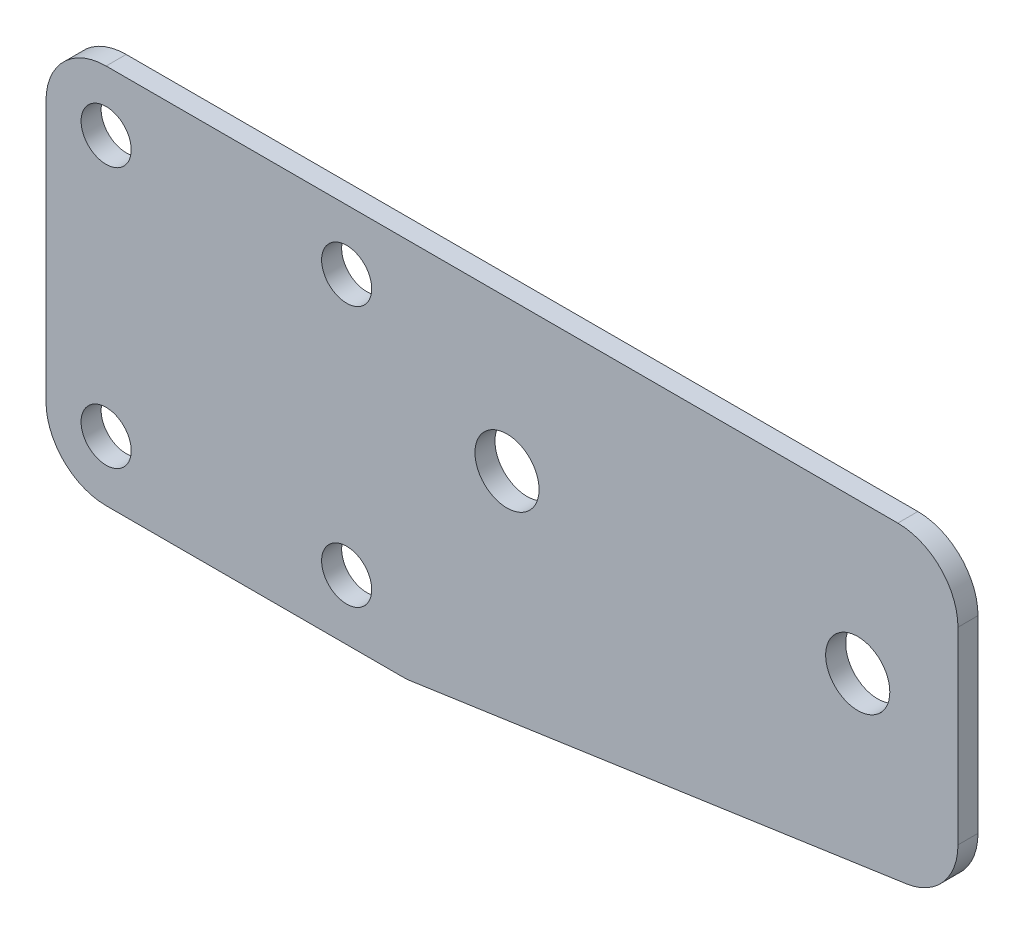
ISO-10303-21;
HEADER;
FILE_DESCRIPTION(('STEP AP214'),'2;1');
FILE_NAME('part.step','',(''),(''),'','','');
FILE_SCHEMA(('AUTOMOTIVE_DESIGN { 1 0 10303 214 1 1 1 1 }'));
ENDSEC;
DATA;
#1=APPLICATION_CONTEXT('core data for automotive mechanical design processes');
#2=APPLICATION_PROTOCOL_DEFINITION('international standard','automotive_design',2000,#1);
#3=PRODUCT_CONTEXT('',#1,'mechanical');
#4=PRODUCT('Part','Part','',(#3));
#5=PRODUCT_RELATED_PRODUCT_CATEGORY('part','',(#4));
#6=PRODUCT_DEFINITION_FORMATION('','',#4);
#7=PRODUCT_DEFINITION_CONTEXT('part definition',#1,'design');
#8=PRODUCT_DEFINITION('design','',#6,#7);
#9=PRODUCT_DEFINITION_SHAPE('','',#8);
#10=(LENGTH_UNIT() NAMED_UNIT(*) SI_UNIT(.MILLI.,.METRE.));
#11=(NAMED_UNIT(*) PLANE_ANGLE_UNIT() SI_UNIT($,.RADIAN.));
#12=(NAMED_UNIT(*) SI_UNIT($,.STERADIAN.) SOLID_ANGLE_UNIT());
#13=UNCERTAINTY_MEASURE_WITH_UNIT(LENGTH_MEASURE(1.E-05),#10,'distance_accuracy_value','');
#14=(GEOMETRIC_REPRESENTATION_CONTEXT(3) GLOBAL_UNCERTAINTY_ASSIGNED_CONTEXT((#13)) GLOBAL_UNIT_ASSIGNED_CONTEXT((#10,
#11,#12)) REPRESENTATION_CONTEXT('',''));
#15=CARTESIAN_POINT('',(0.,0.,0.));
#16=DIRECTION('',(0.,0.,1.));
#17=DIRECTION('',(1.,0.,0.));
#18=AXIS2_PLACEMENT_3D('',#15,#16,#17);
#19=CARTESIAN_POINT('',(0.,0.,1.));
#20=DIRECTION('',(0.,0.,1.));
#21=DIRECTION('',(1.,0.,0.));
#22=AXIS2_PLACEMENT_3D('',#19,#20,#21);
#23=PLANE('',#22);
#24=CARTESIAN_POINT('',(31.5,2.00000000000001,1.));
#25=DIRECTION('',(0.,0.,1.));
#26=DIRECTION('',(1.,0.,0.));
#27=AXIS2_PLACEMENT_3D('',#24,#25,#26);
#28=CIRCLE('',#27,1.6);
#29=CARTESIAN_POINT('',(33.1,2.00000000000001,1.));
#30=VERTEX_POINT('',#29);
#31=EDGE_CURVE('E224',#30,#30,#28,.T.);
#32=ORIENTED_EDGE('',*,*,#31,.F.);
#33=EDGE_LOOP('',(#32));
#34=FACE_BOUND('',#33,.T.);
#35=CARTESIAN_POINT('',(-5.99999999999996,-6.50000000000005,1.));
#36=DIRECTION('',(0.,0.,1.));
#37=DIRECTION('',(-1.,0.,0.));
#38=AXIS2_PLACEMENT_3D('',#35,#36,#37);
#39=CIRCLE('',#38,1.25);
#40=CARTESIAN_POINT('',(-7.24999999999996,-6.50000000000005,1.));
#41=VERTEX_POINT('',#40);
#42=EDGE_CURVE('E212',#41,#41,#39,.T.);
#43=ORIENTED_EDGE('',*,*,#42,.F.);
#44=EDGE_LOOP('',(#43));
#45=FACE_BOUND('',#44,.T.);
#46=CARTESIAN_POINT('',(6.00000000000004,-6.50000000000005,1.));
#47=DIRECTION('',(0.,0.,1.));
#48=DIRECTION('',(1.,0.,0.));
#49=AXIS2_PLACEMENT_3D('',#46,#47,#48);
#50=CIRCLE('',#49,1.25);
#51=CARTESIAN_POINT('',(7.25000000000004,-6.50000000000005,1.));
#52=VERTEX_POINT('',#51);
#53=EDGE_CURVE('E138',#52,#52,#50,.T.);
#54=ORIENTED_EDGE('',*,*,#53,.F.);
#55=EDGE_LOOP('',(#54));
#56=FACE_BOUND('',#55,.T.);
#57=DIRECTION('',(1.,0.,0.));
#58=VECTOR('',#57,1.);
#59=CARTESIAN_POINT('',(-9.,-9.49999999999999,1.));
#60=LINE('',#59,#58);
#61=CARTESIAN_POINT('',(-6.,-9.49999999999999,1.));
#62=VERTEX_POINT('',#61);
#63=CARTESIAN_POINT('',(8.78296015261463,-9.49999999999999,1.));
#64=VERTEX_POINT('',#63);
#65=EDGE_CURVE('E147',#62,#64,#60,.T.);
#66=ORIENTED_EDGE('',*,*,#65,.T.);
#67=CARTESIAN_POINT('',(8.78296015261463,-6.49999999999999,1.));
#68=DIRECTION('',(0.,0.,1.));
#69=DIRECTION('',(1.,0.,0.));
#70=AXIS2_PLACEMENT_3D('',#67,#68,#69);
#71=CIRCLE('',#70,3.);
#72=CARTESIAN_POINT('',(9.21477968975695,-9.46875931785353,1.));
#73=VERTEX_POINT('',#72);
#74=EDGE_CURVE('E173',#64,#73,#71,.T.);
#75=ORIENTED_EDGE('',*,*,#74,.T.);
#76=DIRECTION('',(0.989586439284512,0.143939845714111,0.));
#77=VECTOR('',#76,1.);
#78=CARTESIAN_POINT('',(36.5,-5.49999999999999,1.));
#79=LINE('',#78,#77);
#80=CARTESIAN_POINT('',(33.9318195371423,-5.8735535218702,1.));
#81=VERTEX_POINT('',#80);
#82=EDGE_CURVE('E130',#73,#81,#79,.T.);
#83=ORIENTED_EDGE('',*,*,#82,.T.);
#84=CARTESIAN_POINT('',(33.5,-2.90479420401667,1.));
#85=DIRECTION('',(0.,0.,1.));
#86=DIRECTION('',(1.,0.,0.));
#87=AXIS2_PLACEMENT_3D('',#84,#85,#86);
#88=CIRCLE('',#87,3.);
#89=CARTESIAN_POINT('',(36.5,-2.90479420401667,1.));
#90=VERTEX_POINT('',#89);
#91=EDGE_CURVE('E171',#81,#90,#88,.T.);
#92=ORIENTED_EDGE('',*,*,#91,.T.);
#93=DIRECTION('',(0.,1.,0.));
#94=VECTOR('',#93,1.);
#95=CARTESIAN_POINT('',(36.5,9.50000000000001,1.));
#96=LINE('',#95,#94);
#97=CARTESIAN_POINT('',(36.5,6.5,1.));
#98=VERTEX_POINT('',#97);
#99=EDGE_CURVE('E200',#90,#98,#96,.T.);
#100=ORIENTED_EDGE('',*,*,#99,.T.);
#101=CARTESIAN_POINT('',(33.5,6.5,1.));
#102=DIRECTION('',(0.,0.,1.));
#103=DIRECTION('',(1.,0.,0.));
#104=AXIS2_PLACEMENT_3D('',#101,#102,#103);
#105=CIRCLE('',#104,3.);
#106=CARTESIAN_POINT('',(33.5,9.50000000000001,1.));
#107=VERTEX_POINT('',#106);
#108=EDGE_CURVE('E169',#98,#107,#105,.T.);
#109=ORIENTED_EDGE('',*,*,#108,.T.);
#110=DIRECTION('',(-1.,0.,0.));
#111=VECTOR('',#110,1.);
#112=CARTESIAN_POINT('',(9.,9.5,1.));
#113=LINE('',#112,#111);
#114=CARTESIAN_POINT('',(-6.,9.5,1.));
#115=VERTEX_POINT('',#114);
#116=EDGE_CURVE('E199',#107,#115,#113,.T.);
#117=ORIENTED_EDGE('',*,*,#116,.T.);
#118=CARTESIAN_POINT('',(-6.,6.5,1.));
#119=DIRECTION('',(0.,0.,1.));
#120=DIRECTION('',(1.,0.,0.));
#121=AXIS2_PLACEMENT_3D('',#118,#119,#120);
#122=CIRCLE('',#121,3.);
#123=CARTESIAN_POINT('',(-9.,6.5,1.));
#124=VERTEX_POINT('',#123);
#125=EDGE_CURVE('E53',#115,#124,#122,.T.);
#126=ORIENTED_EDGE('',*,*,#125,.T.);
#127=DIRECTION('',(0.,-1.,0.));
#128=VECTOR('',#127,1.);
#129=CARTESIAN_POINT('',(-9.,9.5,1.));
#130=LINE('',#129,#128);
#131=CARTESIAN_POINT('',(-9.,-6.49999999999999,1.));
#132=VERTEX_POINT('',#131);
#133=EDGE_CURVE('E188',#124,#132,#130,.T.);
#134=ORIENTED_EDGE('',*,*,#133,.T.);
#135=CARTESIAN_POINT('',(-6.,-6.49999999999999,1.));
#136=DIRECTION('',(0.,0.,1.));
#137=DIRECTION('',(1.,0.,0.));
#138=AXIS2_PLACEMENT_3D('',#135,#136,#137);
#139=CIRCLE('',#138,3.);
#140=EDGE_CURVE('E167',#132,#62,#139,.T.);
#141=ORIENTED_EDGE('',*,*,#140,.T.);
#142=EDGE_LOOP('',(#66,#75,#83,#92,#100,#109,#117,#126,#134,#141));
#143=FACE_BOUND('',#142,.T.);
#144=CARTESIAN_POINT('',(6.00000000000004,6.49999999999995,1.));
#145=DIRECTION('',(0.,0.,1.));
#146=DIRECTION('',(-1.,0.,0.));
#147=AXIS2_PLACEMENT_3D('',#144,#145,#146);
#148=CIRCLE('',#147,1.25);
#149=CARTESIAN_POINT('',(4.75000000000004,6.49999999999995,1.));
#150=VERTEX_POINT('',#149);
#151=EDGE_CURVE('E207',#150,#150,#148,.T.);
#152=ORIENTED_EDGE('',*,*,#151,.F.);
#153=EDGE_LOOP('',(#152));
#154=FACE_BOUND('',#153,.T.);
#155=CARTESIAN_POINT('',(-5.99999999999996,6.49999999999994,1.));
#156=DIRECTION('',(0.,0.,1.));
#157=DIRECTION('',(1.,0.,0.));
#158=AXIS2_PLACEMENT_3D('',#155,#156,#157);
#159=CIRCLE('',#158,1.25);
#160=CARTESIAN_POINT('',(-4.74999999999996,6.49999999999994,1.));
#161=VERTEX_POINT('',#160);
#162=EDGE_CURVE('E218',#161,#161,#159,.T.);
#163=ORIENTED_EDGE('',*,*,#162,.F.);
#164=EDGE_LOOP('',(#163));
#165=FACE_BOUND('',#164,.T.);
#166=CARTESIAN_POINT('',(14.,2.00000000000001,1.));
#167=DIRECTION('',(0.,0.,1.));
#168=DIRECTION('',(1.,0.,0.));
#169=AXIS2_PLACEMENT_3D('',#166,#167,#168);
#170=CIRCLE('',#169,1.6);
#171=CARTESIAN_POINT('',(15.6,2.00000000000001,1.));
#172=VERTEX_POINT('',#171);
#173=EDGE_CURVE('E230',#172,#172,#170,.T.);
#174=ORIENTED_EDGE('',*,*,#173,.F.);
#175=EDGE_LOOP('',(#174));
#176=FACE_BOUND('',#175,.T.);
#177=ADVANCED_FACE('F33',(#34,#45,#56,#143,#154,#165,#176),#23,.T.);
#178=CARTESIAN_POINT('',(0.,0.,0.));
#179=DIRECTION('',(0.,0.,1.));
#180=DIRECTION('',(1.,0.,0.));
#181=AXIS2_PLACEMENT_3D('',#178,#179,#180);
#182=PLANE('',#181);
#183=DIRECTION('',(0.989586439284512,0.143939845714111,0.));
#184=VECTOR('',#183,1.);
#185=CARTESIAN_POINT('',(36.5,-5.49999999999999,0.));
#186=LINE('',#185,#184);
#187=CARTESIAN_POINT('',(9.21477968975695,-9.46875931785353,0.));
#188=VERTEX_POINT('',#187);
#189=CARTESIAN_POINT('',(33.9318195371423,-5.8735535218702,0.));
#190=VERTEX_POINT('',#189);
#191=EDGE_CURVE('E127',#188,#190,#186,.T.);
#192=ORIENTED_EDGE('',*,*,#191,.F.);
#193=CARTESIAN_POINT('',(8.78296015261463,-6.49999999999999,0.));
#194=DIRECTION('',(0.,0.,1.));
#195=DIRECTION('',(1.,0.,0.));
#196=AXIS2_PLACEMENT_3D('',#193,#194,#195);
#197=CIRCLE('',#196,3.);
#198=CARTESIAN_POINT('',(8.78296015261463,-9.49999999999999,0.));
#199=VERTEX_POINT('',#198);
#200=EDGE_CURVE('E110',#188,#199,#197,.F.);
#201=ORIENTED_EDGE('',*,*,#200,.T.);
#202=DIRECTION('',(1.,0.,0.));
#203=VECTOR('',#202,1.);
#204=CARTESIAN_POINT('',(-9.,-9.49999999999999,0.));
#205=LINE('',#204,#203);
#206=CARTESIAN_POINT('',(-6.,-9.49999999999999,0.));
#207=VERTEX_POINT('',#206);
#208=EDGE_CURVE('E154',#207,#199,#205,.T.);
#209=ORIENTED_EDGE('',*,*,#208,.F.);
#210=CARTESIAN_POINT('',(-6.,-6.49999999999999,0.));
#211=DIRECTION('',(0.,0.,1.));
#212=DIRECTION('',(1.,0.,0.));
#213=AXIS2_PLACEMENT_3D('',#210,#211,#212);
#214=CIRCLE('',#213,3.);
#215=CARTESIAN_POINT('',(-9.,-6.49999999999999,0.));
#216=VERTEX_POINT('',#215);
#217=EDGE_CURVE('E158',#207,#216,#214,.F.);
#218=ORIENTED_EDGE('',*,*,#217,.T.);
#219=DIRECTION('',(0.,-1.,0.));
#220=VECTOR('',#219,1.);
#221=CARTESIAN_POINT('',(-9.,9.5,0.));
#222=LINE('',#221,#220);
#223=CARTESIAN_POINT('',(-9.,6.5,0.));
#224=VERTEX_POINT('',#223);
#225=EDGE_CURVE('E152',#224,#216,#222,.T.);
#226=ORIENTED_EDGE('',*,*,#225,.F.);
#227=CARTESIAN_POINT('',(-6.,6.5,0.));
#228=DIRECTION('',(0.,0.,1.));
#229=DIRECTION('',(1.,0.,0.));
#230=AXIS2_PLACEMENT_3D('',#227,#228,#229);
#231=CIRCLE('',#230,3.);
#232=CARTESIAN_POINT('',(-6.,9.5,0.));
#233=VERTEX_POINT('',#232);
#234=EDGE_CURVE('E131',#224,#233,#231,.F.);
#235=ORIENTED_EDGE('',*,*,#234,.T.);
#236=DIRECTION('',(-1.,0.,0.));
#237=VECTOR('',#236,1.);
#238=CARTESIAN_POINT('',(-9.,9.5,0.));
#239=LINE('',#238,#237);
#240=CARTESIAN_POINT('',(33.5,9.5,0.));
#241=VERTEX_POINT('',#240);
#242=EDGE_CURVE('E141',#241,#233,#239,.T.);
#243=ORIENTED_EDGE('',*,*,#242,.F.);
#244=CARTESIAN_POINT('',(33.5,6.5,0.));
#245=DIRECTION('',(0.,0.,1.));
#246=DIRECTION('',(1.,0.,0.));
#247=AXIS2_PLACEMENT_3D('',#244,#245,#246);
#248=CIRCLE('',#247,3.);
#249=CARTESIAN_POINT('',(36.5,6.5,0.));
#250=VERTEX_POINT('',#249);
#251=EDGE_CURVE('E160',#241,#250,#248,.F.);
#252=ORIENTED_EDGE('',*,*,#251,.T.);
#253=DIRECTION('',(0.,1.,0.));
#254=VECTOR('',#253,1.);
#255=CARTESIAN_POINT('',(36.5,9.50000000000001,0.));
#256=LINE('',#255,#254);
#257=CARTESIAN_POINT('',(36.5,-2.90479420401667,0.));
#258=VERTEX_POINT('',#257);
#259=EDGE_CURVE('E137',#258,#250,#256,.T.);
#260=ORIENTED_EDGE('',*,*,#259,.F.);
#261=CARTESIAN_POINT('',(33.5,-2.90479420401667,0.));
#262=DIRECTION('',(0.,0.,1.));
#263=DIRECTION('',(1.,0.,0.));
#264=AXIS2_PLACEMENT_3D('',#261,#262,#263);
#265=CIRCLE('',#264,3.);
#266=EDGE_CURVE('E121',#258,#190,#265,.F.);
#267=ORIENTED_EDGE('',*,*,#266,.T.);
#268=EDGE_LOOP('',(#192,#201,#209,#218,#226,#235,#243,#252,#260,#267));
#269=FACE_BOUND('',#268,.T.);
#270=CARTESIAN_POINT('',(6.00000000000004,-6.50000000000005,0.));
#271=DIRECTION('',(0.,0.,1.));
#272=DIRECTION('',(1.,0.,0.));
#273=AXIS2_PLACEMENT_3D('',#270,#271,#272);
#274=CIRCLE('',#273,1.25);
#275=CARTESIAN_POINT('',(7.25000000000004,-6.50000000000005,0.));
#276=VERTEX_POINT('',#275);
#277=EDGE_CURVE('E144',#276,#276,#274,.T.);
#278=ORIENTED_EDGE('',*,*,#277,.T.);
#279=EDGE_LOOP('',(#278));
#280=FACE_BOUND('',#279,.T.);
#281=CARTESIAN_POINT('',(6.00000000000004,6.49999999999995,0.));
#282=DIRECTION('',(0.,0.,1.));
#283=DIRECTION('',(-1.,0.,0.));
#284=AXIS2_PLACEMENT_3D('',#281,#282,#283);
#285=CIRCLE('',#284,1.25);
#286=CARTESIAN_POINT('',(4.75000000000004,6.49999999999995,0.));
#287=VERTEX_POINT('',#286);
#288=EDGE_CURVE('E209',#287,#287,#285,.T.);
#289=ORIENTED_EDGE('',*,*,#288,.T.);
#290=EDGE_LOOP('',(#289));
#291=FACE_BOUND('',#290,.T.);
#292=CARTESIAN_POINT('',(-5.99999999999996,-6.50000000000005,0.));
#293=DIRECTION('',(0.,0.,1.));
#294=DIRECTION('',(-1.,0.,0.));
#295=AXIS2_PLACEMENT_3D('',#292,#293,#294);
#296=CIRCLE('',#295,1.25);
#297=CARTESIAN_POINT('',(-7.24999999999996,-6.50000000000005,0.));
#298=VERTEX_POINT('',#297);
#299=EDGE_CURVE('E215',#298,#298,#296,.T.);
#300=ORIENTED_EDGE('',*,*,#299,.T.);
#301=EDGE_LOOP('',(#300));
#302=FACE_BOUND('',#301,.T.);
#303=CARTESIAN_POINT('',(-5.99999999999996,6.49999999999994,0.));
#304=DIRECTION('',(0.,0.,1.));
#305=DIRECTION('',(1.,0.,0.));
#306=AXIS2_PLACEMENT_3D('',#303,#304,#305);
#307=CIRCLE('',#306,1.25);
#308=CARTESIAN_POINT('',(-4.74999999999996,6.49999999999994,0.));
#309=VERTEX_POINT('',#308);
#310=EDGE_CURVE('E221',#309,#309,#307,.T.);
#311=ORIENTED_EDGE('',*,*,#310,.T.);
#312=EDGE_LOOP('',(#311));
#313=FACE_BOUND('',#312,.T.);
#314=CARTESIAN_POINT('',(31.5,2.00000000000001,0.));
#315=DIRECTION('',(0.,0.,1.));
#316=DIRECTION('',(1.,0.,0.));
#317=AXIS2_PLACEMENT_3D('',#314,#315,#316);
#318=CIRCLE('',#317,1.6);
#319=CARTESIAN_POINT('',(33.1,2.00000000000001,0.));
#320=VERTEX_POINT('',#319);
#321=EDGE_CURVE('E227',#320,#320,#318,.T.);
#322=ORIENTED_EDGE('',*,*,#321,.T.);
#323=EDGE_LOOP('',(#322));
#324=FACE_BOUND('',#323,.T.);
#325=CARTESIAN_POINT('',(14.,2.00000000000001,0.));
#326=DIRECTION('',(0.,0.,1.));
#327=DIRECTION('',(1.,0.,0.));
#328=AXIS2_PLACEMENT_3D('',#325,#326,#327);
#329=CIRCLE('',#328,1.6);
#330=CARTESIAN_POINT('',(15.6,2.00000000000001,0.));
#331=VERTEX_POINT('',#330);
#332=EDGE_CURVE('E233',#331,#331,#329,.T.);
#333=ORIENTED_EDGE('',*,*,#332,.T.);
#334=EDGE_LOOP('',(#333));
#335=FACE_BOUND('',#334,.T.);
#336=ADVANCED_FACE('F134',(#269,#280,#291,#302,#313,#324,#335),#182,.F.);
#337=CARTESIAN_POINT('',(36.5,-5.49999999999999,1.));
#338=DIRECTION('',(-0.143939845714111,0.989586439284511,0.));
#339=DIRECTION('',(-0.989586439284512,-0.143939845714111,0.));
#340=AXIS2_PLACEMENT_3D('',#337,#338,#339);
#341=PLANE('',#340);
#342=ORIENTED_EDGE('',*,*,#82,.F.);
#343=DIRECTION('',(0.,0.,-1.));
#344=VECTOR('',#343,1.);
#345=CARTESIAN_POINT('',(9.21477968975696,-9.46875931785353,1.));
#346=LINE('',#345,#344);
#347=EDGE_CURVE('E114',#73,#188,#346,.T.);
#348=ORIENTED_EDGE('',*,*,#347,.T.);
#349=ORIENTED_EDGE('',*,*,#191,.T.);
#350=DIRECTION('',(0.,0.,-1.));
#351=VECTOR('',#350,1.);
#352=CARTESIAN_POINT('',(33.9318195371423,-5.8735535218702,1.));
#353=LINE('',#352,#351);
#354=EDGE_CURVE('E132',#190,#81,#353,.F.);
#355=ORIENTED_EDGE('',*,*,#354,.T.);
#356=EDGE_LOOP('',(#342,#348,#349,#355));
#357=FACE_BOUND('',#356,.T.);
#358=ADVANCED_FACE('F126',(#357),#341,.F.);
#359=CARTESIAN_POINT('',(36.5,9.50000000000001,1.));
#360=DIRECTION('',(-1.,0.,0.));
#361=DIRECTION('',(0.,0.,1.));
#362=AXIS2_PLACEMENT_3D('',#359,#360,#361);
#363=PLANE('',#362);
#364=ORIENTED_EDGE('',*,*,#99,.F.);
#365=DIRECTION('',(0.,0.,-1.));
#366=VECTOR('',#365,1.);
#367=CARTESIAN_POINT('',(36.5,-2.90479420401667,1.));
#368=LINE('',#367,#366);
#369=EDGE_CURVE('E177',#90,#258,#368,.T.);
#370=ORIENTED_EDGE('',*,*,#369,.T.);
#371=ORIENTED_EDGE('',*,*,#259,.T.);
#372=DIRECTION('',(0.,0.,-1.));
#373=VECTOR('',#372,1.);
#374=CARTESIAN_POINT('',(36.5,6.5,1.));
#375=LINE('',#374,#373);
#376=EDGE_CURVE('E175',#250,#98,#375,.F.);
#377=ORIENTED_EDGE('',*,*,#376,.T.);
#378=EDGE_LOOP('',(#364,#370,#371,#377));
#379=FACE_BOUND('',#378,.T.);
#380=ADVANCED_FACE('F262',(#379),#363,.F.);
#381=CARTESIAN_POINT('',(-9.,9.5,1.));
#382=DIRECTION('',(0.,-1.,0.));
#383=DIRECTION('',(0.,0.,-1.));
#384=AXIS2_PLACEMENT_3D('',#381,#382,#383);
#385=PLANE('',#384);
#386=ORIENTED_EDGE('',*,*,#116,.F.);
#387=DIRECTION('',(0.,0.,-1.));
#388=VECTOR('',#387,1.);
#389=CARTESIAN_POINT('',(33.5,9.5,1.));
#390=LINE('',#389,#388);
#391=EDGE_CURVE('E182',#107,#241,#390,.T.);
#392=ORIENTED_EDGE('',*,*,#391,.T.);
#393=ORIENTED_EDGE('',*,*,#242,.T.);
#394=DIRECTION('',(0.,0.,-1.));
#395=VECTOR('',#394,1.);
#396=CARTESIAN_POINT('',(-6.,9.5,1.));
#397=LINE('',#396,#395);
#398=EDGE_CURVE('E180',#233,#115,#397,.F.);
#399=ORIENTED_EDGE('',*,*,#398,.T.);
#400=EDGE_LOOP('',(#386,#392,#393,#399));
#401=FACE_BOUND('',#400,.T.);
#402=ADVANCED_FACE('F259',(#401),#385,.F.);
#403=CARTESIAN_POINT('',(-9.,9.5,1.));
#404=DIRECTION('',(1.,0.,0.));
#405=DIRECTION('',(0.,0.,-1.));
#406=AXIS2_PLACEMENT_3D('',#403,#404,#405);
#407=PLANE('',#406);
#408=ORIENTED_EDGE('',*,*,#225,.T.);
#409=DIRECTION('',(0.,0.,-1.));
#410=VECTOR('',#409,1.);
#411=CARTESIAN_POINT('',(-9.,-6.49999999999999,1.));
#412=LINE('',#411,#410);
#413=EDGE_CURVE('E11',#216,#132,#412,.F.);
#414=ORIENTED_EDGE('',*,*,#413,.T.);
#415=ORIENTED_EDGE('',*,*,#133,.F.);
#416=DIRECTION('',(0.,0.,-1.));
#417=VECTOR('',#416,1.);
#418=CARTESIAN_POINT('',(-9.,6.5,1.));
#419=LINE('',#418,#417);
#420=EDGE_CURVE('E41',#124,#224,#419,.T.);
#421=ORIENTED_EDGE('',*,*,#420,.T.);
#422=EDGE_LOOP('',(#408,#414,#415,#421));
#423=FACE_BOUND('',#422,.T.);
#424=ADVANCED_FACE('F187',(#423),#407,.F.);
#425=CARTESIAN_POINT('',(-9.,-9.49999999999999,1.));
#426=DIRECTION('',(0.,1.,0.));
#427=DIRECTION('',(0.,0.,1.));
#428=AXIS2_PLACEMENT_3D('',#425,#426,#427);
#429=PLANE('',#428);
#430=ORIENTED_EDGE('',*,*,#208,.T.);
#431=DIRECTION('',(0.,0.,-1.));
#432=VECTOR('',#431,1.);
#433=CARTESIAN_POINT('',(8.78296015261463,-9.49999999999999,1.));
#434=LINE('',#433,#432);
#435=EDGE_CURVE('E115',#199,#64,#434,.F.);
#436=ORIENTED_EDGE('',*,*,#435,.T.);
#437=ORIENTED_EDGE('',*,*,#65,.F.);
#438=DIRECTION('',(0.,0.,-1.));
#439=VECTOR('',#438,1.);
#440=CARTESIAN_POINT('',(-6.,-9.49999999999999,1.));
#441=LINE('',#440,#439);
#442=EDGE_CURVE('E120',#62,#207,#441,.T.);
#443=ORIENTED_EDGE('',*,*,#442,.T.);
#444=EDGE_LOOP('',(#430,#436,#437,#443));
#445=FACE_BOUND('',#444,.T.);
#446=ADVANCED_FACE('F197',(#445),#429,.F.);
#447=CARTESIAN_POINT('',(6.00000000000004,-6.50000000000005,1.));
#448=DIRECTION('',(0.,0.,-1.));
#449=DIRECTION('',(-1.,0.,0.));
#450=AXIS2_PLACEMENT_3D('',#447,#448,#449);
#451=CYLINDRICAL_SURFACE('',#450,1.25);
#452=ORIENTED_EDGE('',*,*,#53,.T.);
#453=EDGE_LOOP('',(#452));
#454=FACE_BOUND('',#453,.T.);
#455=ORIENTED_EDGE('',*,*,#277,.F.);
#456=EDGE_LOOP('',(#455));
#457=FACE_BOUND('',#456,.T.);
#458=ADVANCED_FACE('F252',(#454,#457),#451,.F.);
#459=CARTESIAN_POINT('',(6.00000000000004,6.49999999999995,1.));
#460=DIRECTION('',(0.,0.,-1.));
#461=DIRECTION('',(-1.,0.,0.));
#462=AXIS2_PLACEMENT_3D('',#459,#460,#461);
#463=CYLINDRICAL_SURFACE('',#462,1.25);
#464=ORIENTED_EDGE('',*,*,#151,.T.);
#465=EDGE_LOOP('',(#464));
#466=FACE_BOUND('',#465,.T.);
#467=ORIENTED_EDGE('',*,*,#288,.F.);
#468=EDGE_LOOP('',(#467));
#469=FACE_BOUND('',#468,.T.);
#470=ADVANCED_FACE('F318',(#466,#469),#463,.F.);
#471=CARTESIAN_POINT('',(-5.99999999999996,-6.50000000000005,1.));
#472=DIRECTION('',(0.,0.,-1.));
#473=DIRECTION('',(-1.,0.,0.));
#474=AXIS2_PLACEMENT_3D('',#471,#472,#473);
#475=CYLINDRICAL_SURFACE('',#474,1.25);
#476=ORIENTED_EDGE('',*,*,#42,.T.);
#477=EDGE_LOOP('',(#476));
#478=FACE_BOUND('',#477,.T.);
#479=ORIENTED_EDGE('',*,*,#299,.F.);
#480=EDGE_LOOP('',(#479));
#481=FACE_BOUND('',#480,.T.);
#482=ADVANCED_FACE('F301',(#478,#481),#475,.F.);
#483=CARTESIAN_POINT('',(-5.99999999999996,6.49999999999994,1.));
#484=DIRECTION('',(0.,0.,-1.));
#485=DIRECTION('',(-1.,0.,0.));
#486=AXIS2_PLACEMENT_3D('',#483,#484,#485);
#487=CYLINDRICAL_SURFACE('',#486,1.25);
#488=ORIENTED_EDGE('',*,*,#162,.T.);
#489=EDGE_LOOP('',(#488));
#490=FACE_BOUND('',#489,.T.);
#491=ORIENTED_EDGE('',*,*,#310,.F.);
#492=EDGE_LOOP('',(#491));
#493=FACE_BOUND('',#492,.T.);
#494=ADVANCED_FACE('F297',(#490,#493),#487,.F.);
#495=CARTESIAN_POINT('',(31.5,2.00000000000001,1.));
#496=DIRECTION('',(0.,0.,-1.));
#497=DIRECTION('',(-1.,0.,0.));
#498=AXIS2_PLACEMENT_3D('',#495,#496,#497);
#499=CYLINDRICAL_SURFACE('',#498,1.6);
#500=ORIENTED_EDGE('',*,*,#31,.T.);
#501=EDGE_LOOP('',(#500));
#502=FACE_BOUND('',#501,.T.);
#503=ORIENTED_EDGE('',*,*,#321,.F.);
#504=EDGE_LOOP('',(#503));
#505=FACE_BOUND('',#504,.T.);
#506=ADVANCED_FACE('F300',(#502,#505),#499,.F.);
#507=CARTESIAN_POINT('',(14.,2.00000000000001,1.));
#508=DIRECTION('',(0.,0.,-1.));
#509=DIRECTION('',(-1.,0.,0.));
#510=AXIS2_PLACEMENT_3D('',#507,#508,#509);
#511=CYLINDRICAL_SURFACE('',#510,1.6);
#512=ORIENTED_EDGE('',*,*,#173,.T.);
#513=EDGE_LOOP('',(#512));
#514=FACE_BOUND('',#513,.T.);
#515=ORIENTED_EDGE('',*,*,#332,.F.);
#516=EDGE_LOOP('',(#515));
#517=FACE_BOUND('',#516,.T.);
#518=ADVANCED_FACE('F239',(#514,#517),#511,.F.);
#519=CARTESIAN_POINT('',(8.78296015261463,-6.49999999999999,1.));
#520=DIRECTION('',(0.,0.,-1.));
#521=DIRECTION('',(-1.,0.,0.));
#522=AXIS2_PLACEMENT_3D('',#519,#520,#521);
#523=CYLINDRICAL_SURFACE('',#522,3.);
#524=ORIENTED_EDGE('',*,*,#74,.F.);
#525=ORIENTED_EDGE('',*,*,#435,.F.);
#526=ORIENTED_EDGE('',*,*,#200,.F.);
#527=ORIENTED_EDGE('',*,*,#347,.F.);
#528=EDGE_LOOP('',(#524,#525,#526,#527));
#529=FACE_BOUND('',#528,.T.);
#530=ADVANCED_FACE('F113',(#529),#523,.T.);
#531=CARTESIAN_POINT('',(33.5,-2.90479420401667,1.));
#532=DIRECTION('',(0.,0.,-1.));
#533=DIRECTION('',(-1.,0.,0.));
#534=AXIS2_PLACEMENT_3D('',#531,#532,#533);
#535=CYLINDRICAL_SURFACE('',#534,3.);
#536=ORIENTED_EDGE('',*,*,#91,.F.);
#537=ORIENTED_EDGE('',*,*,#354,.F.);
#538=ORIENTED_EDGE('',*,*,#266,.F.);
#539=ORIENTED_EDGE('',*,*,#369,.F.);
#540=EDGE_LOOP('',(#536,#537,#538,#539));
#541=FACE_BOUND('',#540,.T.);
#542=ADVANCED_FACE('F271',(#541),#535,.T.);
#543=CARTESIAN_POINT('',(33.5,6.5,1.));
#544=DIRECTION('',(0.,0.,-1.));
#545=DIRECTION('',(-1.,0.,0.));
#546=AXIS2_PLACEMENT_3D('',#543,#544,#545);
#547=CYLINDRICAL_SURFACE('',#546,3.);
#548=ORIENTED_EDGE('',*,*,#108,.F.);
#549=ORIENTED_EDGE('',*,*,#376,.F.);
#550=ORIENTED_EDGE('',*,*,#251,.F.);
#551=ORIENTED_EDGE('',*,*,#391,.F.);
#552=EDGE_LOOP('',(#548,#549,#550,#551));
#553=FACE_BOUND('',#552,.T.);
#554=ADVANCED_FACE('F274',(#553),#547,.T.);
#555=CARTESIAN_POINT('',(-6.,-6.49999999999999,1.));
#556=DIRECTION('',(0.,0.,-1.));
#557=DIRECTION('',(-1.,0.,0.));
#558=AXIS2_PLACEMENT_3D('',#555,#556,#557);
#559=CYLINDRICAL_SURFACE('',#558,3.);
#560=ORIENTED_EDGE('',*,*,#140,.F.);
#561=ORIENTED_EDGE('',*,*,#413,.F.);
#562=ORIENTED_EDGE('',*,*,#217,.F.);
#563=ORIENTED_EDGE('',*,*,#442,.F.);
#564=EDGE_LOOP('',(#560,#561,#562,#563));
#565=FACE_BOUND('',#564,.T.);
#566=ADVANCED_FACE('F194',(#565),#559,.T.);
#567=CARTESIAN_POINT('',(-6.,6.5,1.));
#568=DIRECTION('',(0.,0.,-1.));
#569=DIRECTION('',(-1.,0.,0.));
#570=AXIS2_PLACEMENT_3D('',#567,#568,#569);
#571=CYLINDRICAL_SURFACE('',#570,3.);
#572=ORIENTED_EDGE('',*,*,#125,.F.);
#573=ORIENTED_EDGE('',*,*,#398,.F.);
#574=ORIENTED_EDGE('',*,*,#234,.F.);
#575=ORIENTED_EDGE('',*,*,#420,.F.);
#576=EDGE_LOOP('',(#572,#573,#574,#575));
#577=FACE_BOUND('',#576,.T.);
#578=ADVANCED_FACE('F35',(#577),#571,.T.);
#579=CLOSED_SHELL('',(#177,#336,#358,#380,#402,#424,#446,#458,#470,#482,#494,#506,#518,#530,
#542,#554,#566,#578));
#580=MANIFOLD_SOLID_BREP('B2',#579);
#581=ADVANCED_BREP_SHAPE_REPRESENTATION('',(#18,#580),#14);
#582=SHAPE_DEFINITION_REPRESENTATION(#9,#581);
ENDSEC;
END-ISO-10303-21;
